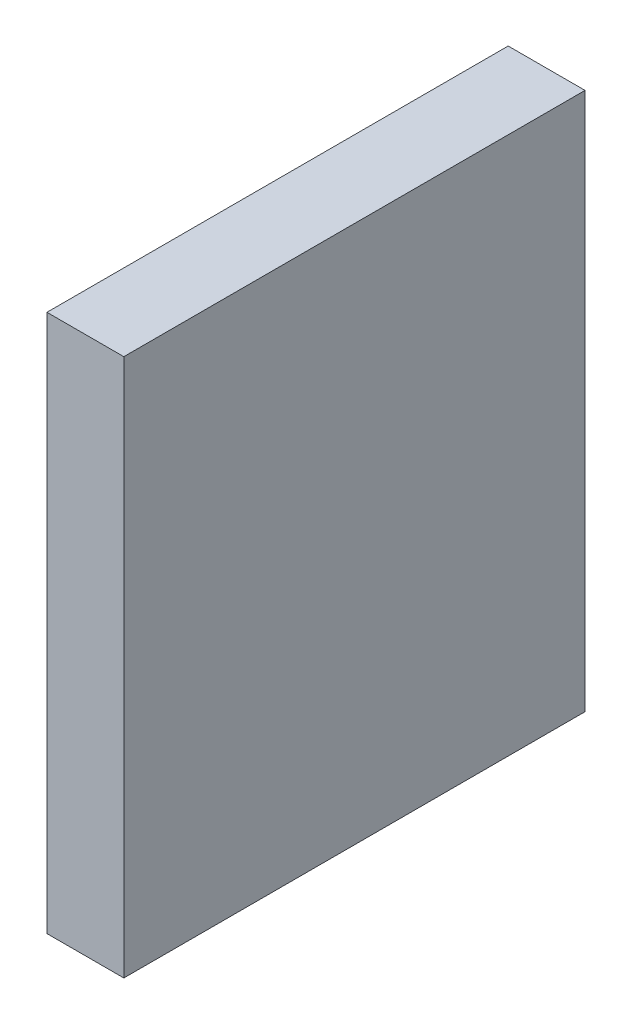
ISO-10303-21;
HEADER;
FILE_DESCRIPTION(('STEP AP214'),'2;1');
FILE_NAME('part.step','',(''),(''),'','','');
FILE_SCHEMA(('AUTOMOTIVE_DESIGN { 1 0 10303 214 1 1 1 1 }'));
ENDSEC;
DATA;
#1=APPLICATION_CONTEXT('core data for automotive mechanical design processes');
#2=APPLICATION_PROTOCOL_DEFINITION('international standard','automotive_design',2000,#1);
#3=PRODUCT_CONTEXT('',#1,'mechanical');
#4=PRODUCT('Part','Part','',(#3));
#5=PRODUCT_RELATED_PRODUCT_CATEGORY('part','',(#4));
#6=PRODUCT_DEFINITION_FORMATION('','',#4);
#7=PRODUCT_DEFINITION_CONTEXT('part definition',#1,'design');
#8=PRODUCT_DEFINITION('design','',#6,#7);
#9=PRODUCT_DEFINITION_SHAPE('','',#8);
#10=(LENGTH_UNIT() NAMED_UNIT(*) SI_UNIT(.MILLI.,.METRE.));
#11=(NAMED_UNIT(*) PLANE_ANGLE_UNIT() SI_UNIT($,.RADIAN.));
#12=(NAMED_UNIT(*) SI_UNIT($,.STERADIAN.) SOLID_ANGLE_UNIT());
#13=UNCERTAINTY_MEASURE_WITH_UNIT(LENGTH_MEASURE(1.E-05),#10,'distance_accuracy_value','');
#14=(GEOMETRIC_REPRESENTATION_CONTEXT(3) GLOBAL_UNCERTAINTY_ASSIGNED_CONTEXT((#13)) GLOBAL_UNIT_ASSIGNED_CONTEXT((#10,
#11,#12)) REPRESENTATION_CONTEXT('',''));
#15=CARTESIAN_POINT('',(0.,0.,0.));
#16=DIRECTION('',(0.,0.,1.));
#17=DIRECTION('',(1.,0.,0.));
#18=AXIS2_PLACEMENT_3D('',#15,#16,#17);
#19=CARTESIAN_POINT('',(25.5,1.87,15.16));
#20=DIRECTION('',(1.,0.,0.));
#21=DIRECTION('',(0.,0.,-1.));
#22=AXIS2_PLACEMENT_3D('',#19,#20,#21);
#23=PLANE('',#22);
#24=DIRECTION('',(0.,0.,1.));
#25=VECTOR('',#24,1.);
#26=CARTESIAN_POINT('',(25.5,2.22,14.86));
#27=LINE('',#26,#25);
#28=CARTESIAN_POINT('',(25.5,2.22,14.86));
#29=VERTEX_POINT('',#28);
#30=CARTESIAN_POINT('',(25.5,2.22,15.46));
#31=VERTEX_POINT('',#30);
#32=EDGE_CURVE('E79',#29,#31,#27,.T.);
#33=ORIENTED_EDGE('',*,*,#32,.F.);
#34=DIRECTION('',(0.,1.,0.));
#35=VECTOR('',#34,1.);
#36=CARTESIAN_POINT('',(25.5,1.52,14.86));
#37=LINE('',#36,#35);
#38=CARTESIAN_POINT('',(25.5,1.52,14.86));
#39=VERTEX_POINT('',#38);
#40=EDGE_CURVE('E55',#39,#29,#37,.T.);
#41=ORIENTED_EDGE('',*,*,#40,.F.);
#42=DIRECTION('',(0.,0.,-1.));
#43=VECTOR('',#42,1.);
#44=CARTESIAN_POINT('',(25.5,1.52,15.46));
#45=LINE('',#44,#43);
#46=CARTESIAN_POINT('',(25.5,1.52,15.46));
#47=VERTEX_POINT('',#46);
#48=EDGE_CURVE('E57',#47,#39,#45,.T.);
#49=ORIENTED_EDGE('',*,*,#48,.F.);
#50=DIRECTION('',(0.,1.,0.));
#51=VECTOR('',#50,1.);
#52=CARTESIAN_POINT('',(25.5,2.22,15.46));
#53=LINE('',#52,#51);
#54=EDGE_CURVE('E20',#31,#47,#53,.F.);
#55=ORIENTED_EDGE('',*,*,#54,.F.);
#56=EDGE_LOOP('',(#33,#41,#49,#55));
#57=FACE_BOUND('',#56,.T.);
#58=ADVANCED_FACE('F17',(#57),#23,.F.);
#59=CARTESIAN_POINT('',(25.5,2.22,15.46));
#60=DIRECTION('',(0.,0.,1.));
#61=DIRECTION('',(1.,0.,0.));
#62=AXIS2_PLACEMENT_3D('',#59,#60,#61);
#63=PLANE('',#62);
#64=DIRECTION('',(0.,1.,0.));
#65=VECTOR('',#64,1.);
#66=CARTESIAN_POINT('',(25.6,1.87,15.46));
#67=LINE('',#66,#65);
#68=CARTESIAN_POINT('',(25.6,2.22,15.46));
#69=VERTEX_POINT('',#68);
#70=CARTESIAN_POINT('',(25.6,1.52,15.46));
#71=VERTEX_POINT('',#70);
#72=EDGE_CURVE('E83',#69,#71,#67,.F.);
#73=ORIENTED_EDGE('',*,*,#72,.F.);
#74=DIRECTION('',(1.,0.,0.));
#75=VECTOR('',#74,1.);
#76=CARTESIAN_POINT('',(25.5,2.22,15.46));
#77=LINE('',#76,#75);
#78=EDGE_CURVE('E68',#31,#69,#77,.T.);
#79=ORIENTED_EDGE('',*,*,#78,.F.);
#80=ORIENTED_EDGE('',*,*,#54,.T.);
#81=DIRECTION('',(1.,0.,0.));
#82=VECTOR('',#81,1.);
#83=CARTESIAN_POINT('',(25.5,1.52,15.46));
#84=LINE('',#83,#82);
#85=EDGE_CURVE('E63',#71,#47,#84,.F.);
#86=ORIENTED_EDGE('',*,*,#85,.F.);
#87=EDGE_LOOP('',(#73,#79,#80,#86));
#88=FACE_BOUND('',#87,.T.);
#89=ADVANCED_FACE('F65',(#88),#63,.T.);
#90=CARTESIAN_POINT('',(25.5,1.52,15.46));
#91=DIRECTION('',(0.,-1.,0.));
#92=DIRECTION('',(0.,0.,-1.));
#93=AXIS2_PLACEMENT_3D('',#90,#91,#92);
#94=PLANE('',#93);
#95=DIRECTION('',(0.,0.,-1.));
#96=VECTOR('',#95,1.);
#97=CARTESIAN_POINT('',(25.6,1.52,15.16));
#98=LINE('',#97,#96);
#99=CARTESIAN_POINT('',(25.6,1.52,14.86));
#100=VERTEX_POINT('',#99);
#101=EDGE_CURVE('E72',#71,#100,#98,.T.);
#102=ORIENTED_EDGE('',*,*,#101,.F.);
#103=ORIENTED_EDGE('',*,*,#85,.T.);
#104=ORIENTED_EDGE('',*,*,#48,.T.);
#105=DIRECTION('',(-1.,0.,0.));
#106=VECTOR('',#105,1.);
#107=CARTESIAN_POINT('',(25.5,1.52,14.86));
#108=LINE('',#107,#106);
#109=EDGE_CURVE('E75',#100,#39,#108,.T.);
#110=ORIENTED_EDGE('',*,*,#109,.F.);
#111=EDGE_LOOP('',(#102,#103,#104,#110));
#112=FACE_BOUND('',#111,.T.);
#113=ADVANCED_FACE('F70',(#112),#94,.T.);
#114=CARTESIAN_POINT('',(25.5,1.52,14.86));
#115=DIRECTION('',(0.,0.,-1.));
#116=DIRECTION('',(-1.,0.,0.));
#117=AXIS2_PLACEMENT_3D('',#114,#115,#116);
#118=PLANE('',#117);
#119=DIRECTION('',(0.,1.,0.));
#120=VECTOR('',#119,1.);
#121=CARTESIAN_POINT('',(25.6,1.87,14.86));
#122=LINE('',#121,#120);
#123=CARTESIAN_POINT('',(25.6,2.22,14.86));
#124=VERTEX_POINT('',#123);
#125=EDGE_CURVE('E26',#100,#124,#122,.T.);
#126=ORIENTED_EDGE('',*,*,#125,.F.);
#127=ORIENTED_EDGE('',*,*,#109,.T.);
#128=ORIENTED_EDGE('',*,*,#40,.T.);
#129=DIRECTION('',(1.,0.,0.));
#130=VECTOR('',#129,1.);
#131=CARTESIAN_POINT('',(25.5,2.22,14.86));
#132=LINE('',#131,#130);
#133=EDGE_CURVE('E35',#124,#29,#132,.F.);
#134=ORIENTED_EDGE('',*,*,#133,.F.);
#135=EDGE_LOOP('',(#126,#127,#128,#134));
#136=FACE_BOUND('',#135,.T.);
#137=ADVANCED_FACE('F89',(#136),#118,.T.);
#138=CARTESIAN_POINT('',(25.5,2.22,14.86));
#139=DIRECTION('',(0.,1.,0.));
#140=DIRECTION('',(0.,0.,1.));
#141=AXIS2_PLACEMENT_3D('',#138,#139,#140);
#142=PLANE('',#141);
#143=DIRECTION('',(0.,0.,-1.));
#144=VECTOR('',#143,1.);
#145=CARTESIAN_POINT('',(25.6,2.22,15.16));
#146=LINE('',#145,#144);
#147=EDGE_CURVE('E11',#124,#69,#146,.F.);
#148=ORIENTED_EDGE('',*,*,#147,.F.);
#149=ORIENTED_EDGE('',*,*,#133,.T.);
#150=ORIENTED_EDGE('',*,*,#32,.T.);
#151=ORIENTED_EDGE('',*,*,#78,.T.);
#152=EDGE_LOOP('',(#148,#149,#150,#151));
#153=FACE_BOUND('',#152,.T.);
#154=ADVANCED_FACE('F91',(#153),#142,.T.);
#155=CARTESIAN_POINT('',(25.6,1.87,15.16));
#156=DIRECTION('',(1.,0.,0.));
#157=DIRECTION('',(0.,0.,-1.));
#158=AXIS2_PLACEMENT_3D('',#155,#156,#157);
#159=PLANE('',#158);
#160=ORIENTED_EDGE('',*,*,#125,.T.);
#161=ORIENTED_EDGE('',*,*,#147,.T.);
#162=ORIENTED_EDGE('',*,*,#72,.T.);
#163=ORIENTED_EDGE('',*,*,#101,.T.);
#164=EDGE_LOOP('',(#160,#161,#162,#163));
#165=FACE_BOUND('',#164,.T.);
#166=ADVANCED_FACE('F88',(#165),#159,.T.);
#167=CLOSED_SHELL('',(#58,#89,#113,#137,#154,#166));
#168=MANIFOLD_SOLID_BREP('B1',#167);
#169=ADVANCED_BREP_SHAPE_REPRESENTATION('',(#18,#168),#14);
#170=SHAPE_DEFINITION_REPRESENTATION(#9,#169);
ENDSEC;
END-ISO-10303-21;
